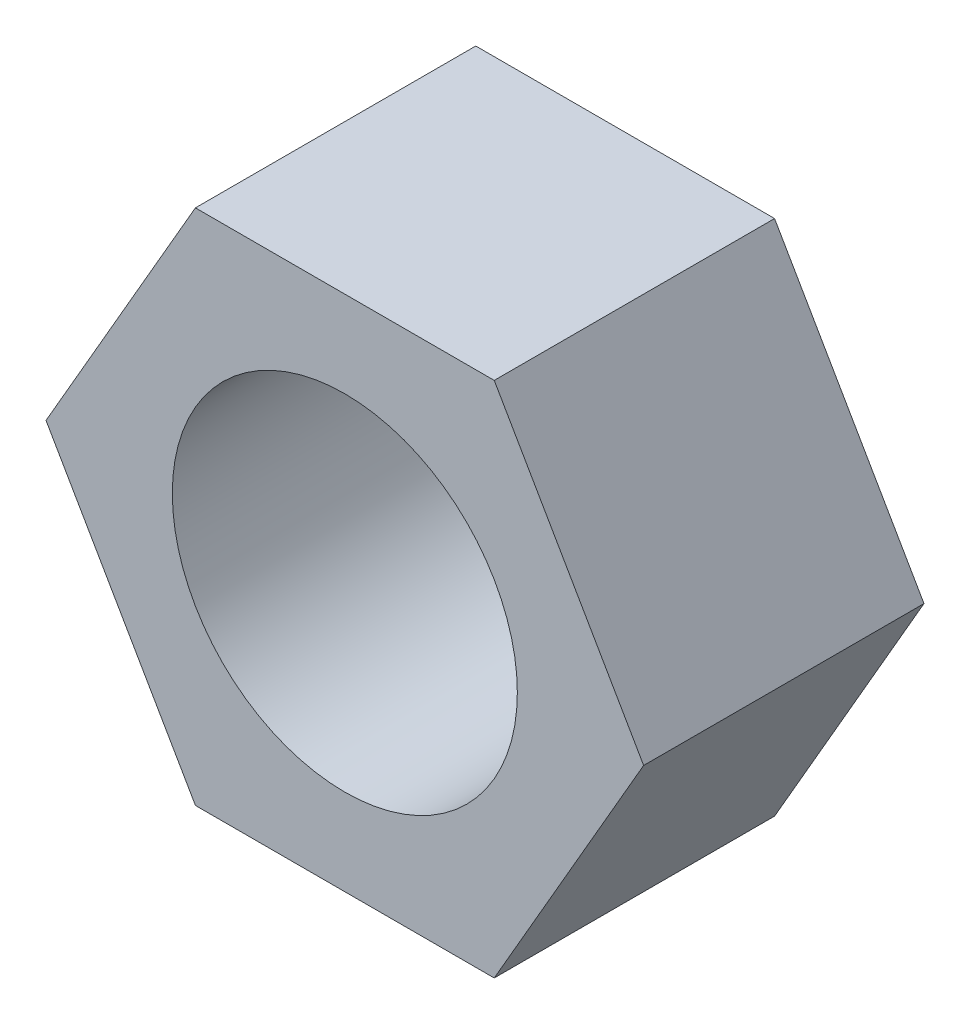
ISO-10303-21;
HEADER;
FILE_DESCRIPTION(('STEP AP214'),'2;1');
FILE_NAME('part.step','',(''),(''),'','','');
FILE_SCHEMA(('AUTOMOTIVE_DESIGN { 1 0 10303 214 1 1 1 1 }'));
ENDSEC;
DATA;
#1=APPLICATION_CONTEXT('core data for automotive mechanical design processes');
#2=APPLICATION_PROTOCOL_DEFINITION('international standard','automotive_design',2000,#1);
#3=PRODUCT_CONTEXT('',#1,'mechanical');
#4=PRODUCT('Part','Part','',(#3));
#5=PRODUCT_RELATED_PRODUCT_CATEGORY('part','',(#4));
#6=PRODUCT_DEFINITION_FORMATION('','',#4);
#7=PRODUCT_DEFINITION_CONTEXT('part definition',#1,'design');
#8=PRODUCT_DEFINITION('design','',#6,#7);
#9=PRODUCT_DEFINITION_SHAPE('','',#8);
#10=(LENGTH_UNIT() NAMED_UNIT(*) SI_UNIT(.MILLI.,.METRE.));
#11=(NAMED_UNIT(*) PLANE_ANGLE_UNIT() SI_UNIT($,.RADIAN.));
#12=(NAMED_UNIT(*) SI_UNIT($,.STERADIAN.) SOLID_ANGLE_UNIT());
#13=UNCERTAINTY_MEASURE_WITH_UNIT(LENGTH_MEASURE(1.E-05),#10,'distance_accuracy_value','');
#14=(GEOMETRIC_REPRESENTATION_CONTEXT(3) GLOBAL_UNCERTAINTY_ASSIGNED_CONTEXT((#13)) GLOBAL_UNIT_ASSIGNED_CONTEXT((#10,
#11,#12)) REPRESENTATION_CONTEXT('',''));
#15=CARTESIAN_POINT('',(0.,0.,0.));
#16=DIRECTION('',(0.,0.,1.));
#17=DIRECTION('',(1.,0.,0.));
#18=AXIS2_PLACEMENT_3D('',#15,#16,#17);
#19=CARTESIAN_POINT('',(0.,0.,6.5));
#20=DIRECTION('',(0.,0.,1.));
#21=DIRECTION('',(1.,0.,0.));
#22=AXIS2_PLACEMENT_3D('',#19,#20,#21);
#23=PLANE('',#22);
#24=DIRECTION('',(0.499999999999995,0.866025403784441,0.));
#25=VECTOR('',#24,1.);
#26=CARTESIAN_POINT('',(3.46410161513781,-5.99999999999994,6.5));
#27=LINE('',#26,#25);
#28=CARTESIAN_POINT('',(3.46410161513781,-5.99999999999994,6.5));
#29=VERTEX_POINT('',#28);
#30=CARTESIAN_POINT('',(6.92820323027549,0.,6.5));
#31=VERTEX_POINT('',#30);
#32=EDGE_CURVE('E132',#29,#31,#27,.T.);
#33=ORIENTED_EDGE('',*,*,#32,.T.);
#34=DIRECTION('',(-0.500000000000001,0.866025403784438,0.));
#35=VECTOR('',#34,1.);
#36=CARTESIAN_POINT('',(6.92820323027549,0.,6.5));
#37=LINE('',#36,#35);
#38=CARTESIAN_POINT('',(3.46410161513773,5.99999999999999,6.5));
#39=VERTEX_POINT('',#38);
#40=EDGE_CURVE('E90',#31,#39,#37,.T.);
#41=ORIENTED_EDGE('',*,*,#40,.T.);
#42=DIRECTION('',(-1.,0.,0.));
#43=VECTOR('',#42,1.);
#44=CARTESIAN_POINT('',(3.46410161513773,5.99999999999999,6.5));
#45=LINE('',#44,#43);
#46=CARTESIAN_POINT('',(-3.46410161513777,5.99999999999996,6.5));
#47=VERTEX_POINT('',#46);
#48=EDGE_CURVE('E103',#39,#47,#45,.T.);
#49=ORIENTED_EDGE('',*,*,#48,.T.);
#50=DIRECTION('',(-0.499999999999995,-0.866025403784442,0.));
#51=VECTOR('',#50,1.);
#52=CARTESIAN_POINT('',(-3.46410161513777,5.99999999999996,6.5));
#53=LINE('',#52,#51);
#54=CARTESIAN_POINT('',(-6.92820323027549,0.,6.5));
#55=VERTEX_POINT('',#54);
#56=EDGE_CURVE('E97',#47,#55,#53,.T.);
#57=ORIENTED_EDGE('',*,*,#56,.T.);
#58=DIRECTION('',(0.500000000000007,-0.866025403784434,0.));
#59=VECTOR('',#58,1.);
#60=CARTESIAN_POINT('',(-6.92820323027549,0.,6.5));
#61=LINE('',#60,#59);
#62=CARTESIAN_POINT('',(-3.46410161513769,-6.00000000000001,6.5));
#63=VERTEX_POINT('',#62);
#64=EDGE_CURVE('E101',#55,#63,#61,.T.);
#65=ORIENTED_EDGE('',*,*,#64,.T.);
#66=DIRECTION('',(1.,0.,0.));
#67=VECTOR('',#66,1.);
#68=CARTESIAN_POINT('',(-3.46410161513769,-6.00000000000001,6.5));
#69=LINE('',#68,#67);
#70=EDGE_CURVE('E53',#63,#29,#69,.T.);
#71=ORIENTED_EDGE('',*,*,#70,.T.);
#72=EDGE_LOOP('',(#33,#41,#49,#57,#65,#71));
#73=FACE_BOUND('',#72,.T.);
#74=CARTESIAN_POINT('',(0.,0.,6.5));
#75=DIRECTION('',(0.,0.,1.));
#76=DIRECTION('',(1.,0.,0.));
#77=AXIS2_PLACEMENT_3D('',#74,#75,#76);
#78=CIRCLE('',#77,4.);
#79=CARTESIAN_POINT('',(4.,0.,6.5));
#80=VERTEX_POINT('',#79);
#81=EDGE_CURVE('E125',#80,#80,#78,.T.);
#82=ORIENTED_EDGE('',*,*,#81,.F.);
#83=EDGE_LOOP('',(#82));
#84=FACE_BOUND('',#83,.T.);
#85=ADVANCED_FACE('F36',(#73,#84),#23,.T.);
#86=CARTESIAN_POINT('',(0.,0.,0.));
#87=DIRECTION('',(0.,0.,1.));
#88=DIRECTION('',(1.,0.,0.));
#89=AXIS2_PLACEMENT_3D('',#86,#87,#88);
#90=PLANE('',#89);
#91=DIRECTION('',(0.499999999999995,0.866025403784441,0.));
#92=VECTOR('',#91,1.);
#93=CARTESIAN_POINT('',(3.46410161513781,-5.99999999999994,0.));
#94=LINE('',#93,#92);
#95=CARTESIAN_POINT('',(3.46410161513781,-5.99999999999994,0.));
#96=VERTEX_POINT('',#95);
#97=CARTESIAN_POINT('',(6.92820323027549,0.,0.));
#98=VERTEX_POINT('',#97);
#99=EDGE_CURVE('E121',#96,#98,#94,.T.);
#100=ORIENTED_EDGE('',*,*,#99,.F.);
#101=DIRECTION('',(1.,0.,0.));
#102=VECTOR('',#101,1.);
#103=CARTESIAN_POINT('',(-3.46410161513769,-6.00000000000001,0.));
#104=LINE('',#103,#102);
#105=CARTESIAN_POINT('',(-3.46410161513769,-6.00000000000001,0.));
#106=VERTEX_POINT('',#105);
#107=EDGE_CURVE('E82',#106,#96,#104,.T.);
#108=ORIENTED_EDGE('',*,*,#107,.F.);
#109=DIRECTION('',(0.500000000000007,-0.866025403784434,0.));
#110=VECTOR('',#109,1.);
#111=CARTESIAN_POINT('',(-6.92820323027549,0.,0.));
#112=LINE('',#111,#110);
#113=CARTESIAN_POINT('',(-6.92820323027549,0.,0.));
#114=VERTEX_POINT('',#113);
#115=EDGE_CURVE('E76',#114,#106,#112,.T.);
#116=ORIENTED_EDGE('',*,*,#115,.F.);
#117=DIRECTION('',(-0.499999999999995,-0.866025403784442,0.));
#118=VECTOR('',#117,1.);
#119=CARTESIAN_POINT('',(-3.46410161513777,5.99999999999996,0.));
#120=LINE('',#119,#118);
#121=CARTESIAN_POINT('',(-3.46410161513777,5.99999999999996,0.));
#122=VERTEX_POINT('',#121);
#123=EDGE_CURVE('E111',#122,#114,#120,.T.);
#124=ORIENTED_EDGE('',*,*,#123,.F.);
#125=DIRECTION('',(-1.,0.,0.));
#126=VECTOR('',#125,1.);
#127=CARTESIAN_POINT('',(3.46410161513773,5.99999999999999,0.));
#128=LINE('',#127,#126);
#129=CARTESIAN_POINT('',(3.46410161513773,5.99999999999999,0.));
#130=VERTEX_POINT('',#129);
#131=EDGE_CURVE('E127',#130,#122,#128,.T.);
#132=ORIENTED_EDGE('',*,*,#131,.F.);
#133=DIRECTION('',(-0.500000000000001,0.866025403784438,0.));
#134=VECTOR('',#133,1.);
#135=CARTESIAN_POINT('',(6.92820323027549,0.,0.));
#136=LINE('',#135,#134);
#137=EDGE_CURVE('E124',#98,#130,#136,.T.);
#138=ORIENTED_EDGE('',*,*,#137,.F.);
#139=EDGE_LOOP('',(#100,#108,#116,#124,#132,#138));
#140=FACE_BOUND('',#139,.T.);
#141=CARTESIAN_POINT('',(0.,0.,0.));
#142=DIRECTION('',(0.,0.,1.));
#143=DIRECTION('',(1.,0.,0.));
#144=AXIS2_PLACEMENT_3D('',#141,#142,#143);
#145=CIRCLE('',#144,4.);
#146=CARTESIAN_POINT('',(4.,0.,0.));
#147=VERTEX_POINT('',#146);
#148=EDGE_CURVE('E225',#147,#147,#145,.T.);
#149=ORIENTED_EDGE('',*,*,#148,.T.);
#150=EDGE_LOOP('',(#149));
#151=FACE_BOUND('',#150,.T.);
#152=ADVANCED_FACE('F141',(#140,#151),#90,.F.);
#153=CARTESIAN_POINT('',(3.46410161513781,-5.99999999999994,6.5));
#154=DIRECTION('',(-0.866025403784441,0.499999999999995,0.));
#155=DIRECTION('',(-0.499999999999995,-0.866025403784442,0.));
#156=AXIS2_PLACEMENT_3D('',#153,#154,#155);
#157=PLANE('',#156);
#158=ORIENTED_EDGE('',*,*,#99,.T.);
#159=DIRECTION('',(0.,0.,-1.));
#160=VECTOR('',#159,1.);
#161=CARTESIAN_POINT('',(6.92820323027549,0.,6.5));
#162=LINE('',#161,#160);
#163=EDGE_CURVE('E11',#31,#98,#162,.T.);
#164=ORIENTED_EDGE('',*,*,#163,.F.);
#165=ORIENTED_EDGE('',*,*,#32,.F.);
#166=DIRECTION('',(0.,0.,-1.));
#167=VECTOR('',#166,1.);
#168=CARTESIAN_POINT('',(3.46410161513781,-5.99999999999994,6.5));
#169=LINE('',#168,#167);
#170=EDGE_CURVE('E117',#29,#96,#169,.T.);
#171=ORIENTED_EDGE('',*,*,#170,.T.);
#172=EDGE_LOOP('',(#158,#164,#165,#171));
#173=FACE_BOUND('',#172,.T.);
#174=ADVANCED_FACE('F38',(#173),#157,.F.);
#175=CARTESIAN_POINT('',(6.92820323027549,0.,6.5));
#176=DIRECTION('',(-0.866025403784438,-0.500000000000001,0.));
#177=DIRECTION('',(0.500000000000001,-0.866025403784438,0.));
#178=AXIS2_PLACEMENT_3D('',#175,#176,#177);
#179=PLANE('',#178);
#180=ORIENTED_EDGE('',*,*,#137,.T.);
#181=DIRECTION('',(0.,0.,-1.));
#182=VECTOR('',#181,1.);
#183=CARTESIAN_POINT('',(3.46410161513773,5.99999999999999,6.5));
#184=LINE('',#183,#182);
#185=EDGE_CURVE('E45',#39,#130,#184,.T.);
#186=ORIENTED_EDGE('',*,*,#185,.F.);
#187=ORIENTED_EDGE('',*,*,#40,.F.);
#188=ORIENTED_EDGE('',*,*,#163,.T.);
#189=EDGE_LOOP('',(#180,#186,#187,#188));
#190=FACE_BOUND('',#189,.T.);
#191=ADVANCED_FACE('F166',(#190),#179,.F.);
#192=CARTESIAN_POINT('',(3.46410161513773,5.99999999999999,6.5));
#193=DIRECTION('',(0.,-1.,0.));
#194=DIRECTION('',(1.,0.,0.));
#195=AXIS2_PLACEMENT_3D('',#192,#193,#194);
#196=PLANE('',#195);
#197=ORIENTED_EDGE('',*,*,#131,.T.);
#198=DIRECTION('',(0.,0.,-1.));
#199=VECTOR('',#198,1.);
#200=CARTESIAN_POINT('',(-3.46410161513777,5.99999999999996,6.5));
#201=LINE('',#200,#199);
#202=EDGE_CURVE('E112',#47,#122,#201,.T.);
#203=ORIENTED_EDGE('',*,*,#202,.F.);
#204=ORIENTED_EDGE('',*,*,#48,.F.);
#205=ORIENTED_EDGE('',*,*,#185,.T.);
#206=EDGE_LOOP('',(#197,#203,#204,#205));
#207=FACE_BOUND('',#206,.T.);
#208=ADVANCED_FACE('F138',(#207),#196,.F.);
#209=CARTESIAN_POINT('',(-3.46410161513777,5.99999999999996,6.5));
#210=DIRECTION('',(0.866025403784442,-0.499999999999995,0.));
#211=DIRECTION('',(0.499999999999995,0.866025403784442,0.));
#212=AXIS2_PLACEMENT_3D('',#209,#210,#211);
#213=PLANE('',#212);
#214=ORIENTED_EDGE('',*,*,#123,.T.);
#215=DIRECTION('',(0.,0.,-1.));
#216=VECTOR('',#215,1.);
#217=CARTESIAN_POINT('',(-6.92820323027549,0.,6.5));
#218=LINE('',#217,#216);
#219=EDGE_CURVE('E108',#55,#114,#218,.T.);
#220=ORIENTED_EDGE('',*,*,#219,.F.);
#221=ORIENTED_EDGE('',*,*,#56,.F.);
#222=ORIENTED_EDGE('',*,*,#202,.T.);
#223=EDGE_LOOP('',(#214,#220,#221,#222));
#224=FACE_BOUND('',#223,.T.);
#225=ADVANCED_FACE('F109',(#224),#213,.F.);
#226=CARTESIAN_POINT('',(-6.92820323027549,0.,6.5));
#227=DIRECTION('',(0.866025403784434,0.500000000000007,0.));
#228=DIRECTION('',(-0.500000000000007,0.866025403784435,0.));
#229=AXIS2_PLACEMENT_3D('',#226,#227,#228);
#230=PLANE('',#229);
#231=ORIENTED_EDGE('',*,*,#115,.T.);
#232=DIRECTION('',(0.,0.,-1.));
#233=VECTOR('',#232,1.);
#234=CARTESIAN_POINT('',(-3.46410161513769,-6.00000000000001,6.5));
#235=LINE('',#234,#233);
#236=EDGE_CURVE('E113',#63,#106,#235,.T.);
#237=ORIENTED_EDGE('',*,*,#236,.F.);
#238=ORIENTED_EDGE('',*,*,#64,.F.);
#239=ORIENTED_EDGE('',*,*,#219,.T.);
#240=EDGE_LOOP('',(#231,#237,#238,#239));
#241=FACE_BOUND('',#240,.T.);
#242=ADVANCED_FACE('F115',(#241),#230,.F.);
#243=CARTESIAN_POINT('',(-3.46410161513769,-6.00000000000001,6.5));
#244=DIRECTION('',(0.,1.,0.));
#245=DIRECTION('',(-1.,0.,0.));
#246=AXIS2_PLACEMENT_3D('',#243,#244,#245);
#247=PLANE('',#246);
#248=ORIENTED_EDGE('',*,*,#107,.T.);
#249=ORIENTED_EDGE('',*,*,#170,.F.);
#250=ORIENTED_EDGE('',*,*,#70,.F.);
#251=ORIENTED_EDGE('',*,*,#236,.T.);
#252=EDGE_LOOP('',(#248,#249,#250,#251));
#253=FACE_BOUND('',#252,.T.);
#254=ADVANCED_FACE('F146',(#253),#247,.F.);
#255=CARTESIAN_POINT('',(0.,0.,6.5));
#256=DIRECTION('',(0.,0.,-1.));
#257=DIRECTION('',(-1.,0.,0.));
#258=AXIS2_PLACEMENT_3D('',#255,#256,#257);
#259=CYLINDRICAL_SURFACE('',#258,4.);
#260=ORIENTED_EDGE('',*,*,#81,.T.);
#261=EDGE_LOOP('',(#260));
#262=FACE_BOUND('',#261,.T.);
#263=ORIENTED_EDGE('',*,*,#148,.F.);
#264=EDGE_LOOP('',(#263));
#265=FACE_BOUND('',#264,.T.);
#266=ADVANCED_FACE('F148',(#262,#265),#259,.F.);
#267=CLOSED_SHELL('',(#85,#152,#174,#191,#208,#225,#242,#254,#266));
#268=MANIFOLD_SOLID_BREP('B2',#267);
#269=ADVANCED_BREP_SHAPE_REPRESENTATION('',(#18,#268),#14);
#270=SHAPE_DEFINITION_REPRESENTATION(#9,#269);
ENDSEC;
END-ISO-10303-21;
